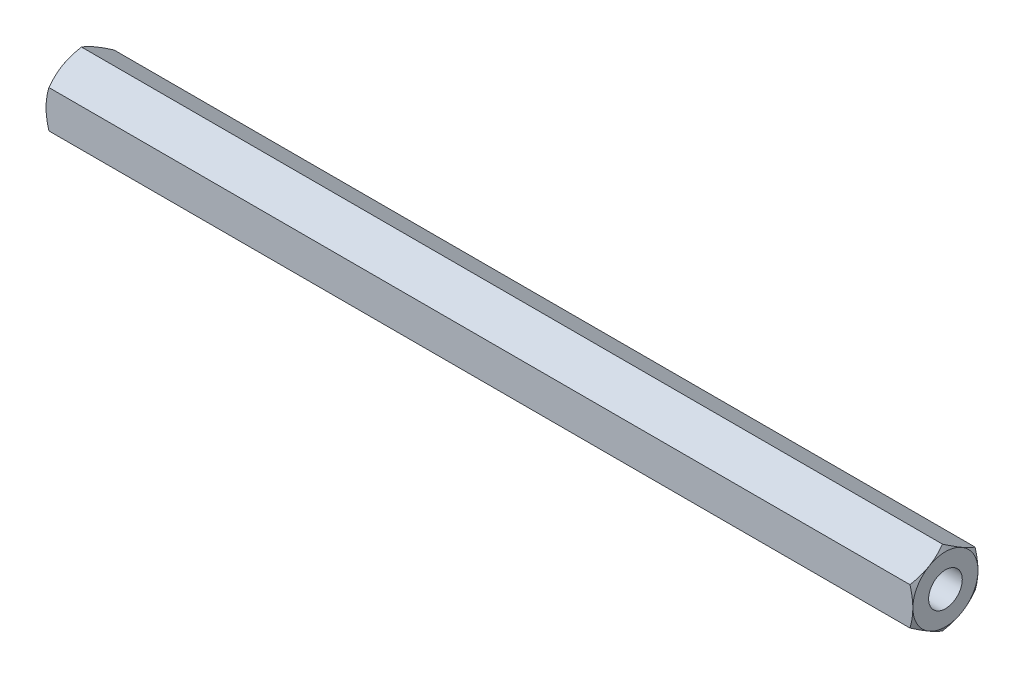
ISO-10303-21;
HEADER;
FILE_DESCRIPTION(('STEP AP214'),'2;1');
FILE_NAME('part.step','',(''),(''),'','','');
FILE_SCHEMA(('AUTOMOTIVE_DESIGN { 1 0 10303 214 1 1 1 1 }'));
ENDSEC;
DATA;
#1=APPLICATION_CONTEXT('core data for automotive mechanical design processes');
#2=APPLICATION_PROTOCOL_DEFINITION('international standard','automotive_design',2000,#1);
#3=PRODUCT_CONTEXT('',#1,'mechanical');
#4=PRODUCT('Part','Part','',(#3));
#5=PRODUCT_RELATED_PRODUCT_CATEGORY('part','',(#4));
#6=PRODUCT_DEFINITION_FORMATION('','',#4);
#7=PRODUCT_DEFINITION_CONTEXT('part definition',#1,'design');
#8=PRODUCT_DEFINITION('design','',#6,#7);
#9=PRODUCT_DEFINITION_SHAPE('','',#8);
#10=(LENGTH_UNIT() NAMED_UNIT(*) SI_UNIT(.MILLI.,.METRE.));
#11=(NAMED_UNIT(*) PLANE_ANGLE_UNIT() SI_UNIT($,.RADIAN.));
#12=(NAMED_UNIT(*) SI_UNIT($,.STERADIAN.) SOLID_ANGLE_UNIT());
#13=UNCERTAINTY_MEASURE_WITH_UNIT(LENGTH_MEASURE(1.E-05),#10,'distance_accuracy_value','');
#14=(GEOMETRIC_REPRESENTATION_CONTEXT(3) GLOBAL_UNCERTAINTY_ASSIGNED_CONTEXT((#13)) GLOBAL_UNIT_ASSIGNED_CONTEXT((#10,
#11,#12)) REPRESENTATION_CONTEXT('',''));
#15=CARTESIAN_POINT('',(0.,0.,0.));
#16=DIRECTION('',(0.,0.,1.));
#17=DIRECTION('',(1.,0.,0.));
#18=AXIS2_PLACEMENT_3D('',#15,#16,#17);
#19=CARTESIAN_POINT('',(106.5,-2.3094010767585,4.));
#20=DIRECTION('',(0.,0.866025403784439,-0.5));
#21=DIRECTION('',(0.,0.5,0.866025403784439));
#22=AXIS2_PLACEMENT_3D('',#19,#20,#21);
#23=PLANE('',#22);
#24=CARTESIAN_POINT('',(106.142667740925,-2.30928560670466,4.0002));
#25=CARTESIAN_POINT('',(106.201282126352,-2.4107717464617,3.82442084967677));
#26=CARTESIAN_POINT('',(106.254589678538,-2.51313390883499,3.64712438367362));
#27=CARTESIAN_POINT('',(106.347638329254,-2.71963072479811,3.28946140682429));
#28=CARTESIAN_POINT('',(106.38734651097,-2.82376904741904,3.10908854102985));
#29=CARTESIAN_POINT('',(106.44915778472,-3.03075510011795,2.75057818129721));
#30=CARTESIAN_POINT('',(106.471672268477,-3.13357098372492,2.57249584706486));
#31=CARTESIAN_POINT('',(106.498549376853,-3.33968651028528,2.21549328283349));
#32=CARTESIAN_POINT('',(106.502934258573,-3.44298540411434,2.0365743503559));
#33=CARTESIAN_POINT('',(106.49380992706,-3.63600352522932,1.70225715780327));
#34=CARTESIAN_POINT('',(106.482541046012,-3.72575165335065,1.54680884001293));
#35=CARTESIAN_POINT('',(106.446826009202,-3.90466320392054,1.23692494436494));
#36=CARTESIAN_POINT('',(106.422367654288,-3.99382600759478,1.08249043825587));
#37=CARTESIAN_POINT('',(106.361223935081,-4.17310641015197,0.771967672225423));
#38=CARTESIAN_POINT('',(106.324279396345,-4.26320131938131,0.615918711936898));
#39=CARTESIAN_POINT('',(106.240429927452,-4.4420474282755,0.306148164596161));
#40=CARTESIAN_POINT('',(106.193544697787,-4.53080091904966,0.152422609226221));
#41=CARTESIAN_POINT('',(106.142667740925,-4.61891762357084,-0.000199999999999231));
#42=B_SPLINE_CURVE_WITH_KNOTS('',3,(#24,#25,#26,#27,#28,#29,#30,#31,#32,#33,#34,#35,#36,#37,#38,
#39,#40,#41),.UNSPECIFIED.,.F.,.F.,(4,2,2,2,2,2,2,2,4),(0.,0.634047835695965,1.26961969224543,
1.88946157213122,2.50854226669297,3.04757825393386,3.58711366126903,4.13861653143764,
4.68903648037743),.UNSPECIFIED.);
#43=CARTESIAN_POINT('',(106.142734410092,-2.3094010767585,4.));
#44=VERTEX_POINT('',#43);
#45=CARTESIAN_POINT('',(106.5,-3.46410161513776,2.));
#46=VERTEX_POINT('',#45);
#47=EDGE_CURVE('E272',#44,#46,#42,.T.);
#48=ORIENTED_EDGE('',*,*,#47,.F.);
#49=DIRECTION('',(-1.,0.,0.));
#50=VECTOR('',#49,1.);
#51=CARTESIAN_POINT('',(106.5,-2.3094010767585,4.));
#52=LINE('',#51,#50);
#53=CARTESIAN_POINT('',(0.357265589908165,-2.30940107675851,4.));
#54=VERTEX_POINT('',#53);
#55=EDGE_CURVE('E337',#44,#54,#52,.T.);
#56=ORIENTED_EDGE('',*,*,#55,.T.);
#57=CARTESIAN_POINT('',(0.357332259074767,-4.61891762357084,-0.00019999999999909));
#58=CARTESIAN_POINT('',(0.298717873648283,-4.5174314838138,0.175579150323229));
#59=CARTESIAN_POINT('',(0.245410321462263,-4.41506932144052,0.352875616326382));
#60=CARTESIAN_POINT('',(0.152361670746403,-4.20857250547739,0.710538593175708));
#61=CARTESIAN_POINT('',(0.112653489029703,-4.10443418285647,0.890911458970153));
#62=CARTESIAN_POINT('',(0.0508422152802781,-3.89744813015756,1.24942181870279));
#63=CARTESIAN_POINT('',(0.0283277315228878,-3.79463224655059,1.42750415293514));
#64=CARTESIAN_POINT('',(0.00145062314658089,-3.58851671999023,1.78450671716651));
#65=CARTESIAN_POINT('',(-0.00293425857305764,-3.48521782616117,1.9634256496441));
#66=CARTESIAN_POINT('',(0.00619007293996928,-3.29219970504619,2.29774284219673));
#67=CARTESIAN_POINT('',(0.0174589539879931,-3.20245157692486,2.45319115998707));
#68=CARTESIAN_POINT('',(0.0531739907981922,-3.02354002635496,2.76307505563506));
#69=CARTESIAN_POINT('',(0.0776323457115324,-2.93437722268072,2.91750956174413));
#70=CARTESIAN_POINT('',(0.138776064919289,-2.75509682012354,3.22803232777458));
#71=CARTESIAN_POINT('',(0.175720603654863,-2.6650019108942,3.3840812880631));
#72=CARTESIAN_POINT('',(0.259570072548027,-2.486155802,3.69385183540384));
#73=CARTESIAN_POINT('',(0.306455302212741,-2.39740231122585,3.84757739077378));
#74=CARTESIAN_POINT('',(0.357332259074768,-2.30928560670466,4.0002));
#75=B_SPLINE_CURVE_WITH_KNOTS('',3,(#57,#58,#59,#60,#61,#62,#63,#64,#65,#66,#67,#68,#69,#70,#71,
#72,#73,#74),.UNSPECIFIED.,.F.,.F.,(4,2,2,2,2,2,2,2,4),(0.,0.634047835695966,1.26961969224544,
1.88946157213122,2.50854226669297,3.04757825393386,3.58711366126904,4.13861653143764,
4.68903648037743),.UNSPECIFIED.);
#76=CARTESIAN_POINT('',(0.,-3.46410161513776,2.));
#77=VERTEX_POINT('',#76);
#78=EDGE_CURVE('E220',#77,#54,#75,.T.);
#79=ORIENTED_EDGE('',*,*,#78,.F.);
#80=CARTESIAN_POINT('',(0.357265589908165,-4.61880215351701,0.));
#81=VERTEX_POINT('',#80);
#82=EDGE_CURVE('E335',#81,#77,#75,.T.);
#83=ORIENTED_EDGE('',*,*,#82,.F.);
#84=DIRECTION('',(-1.,0.,0.));
#85=VECTOR('',#84,1.);
#86=CARTESIAN_POINT('',(106.5,-4.61880215351701,0.));
#87=LINE('',#86,#85);
#88=CARTESIAN_POINT('',(106.142734410092,-4.61880215351701,0.));
#89=VERTEX_POINT('',#88);
#90=EDGE_CURVE('E298',#89,#81,#87,.T.);
#91=ORIENTED_EDGE('',*,*,#90,.F.);
#92=EDGE_CURVE('E267',#46,#89,#42,.T.);
#93=ORIENTED_EDGE('',*,*,#92,.F.);
#94=EDGE_LOOP('',(#48,#56,#79,#83,#91,#93));
#95=FACE_BOUND('',#94,.T.);
#96=ADVANCED_FACE('F41',(#95),#23,.F.);
#97=CARTESIAN_POINT('',(106.5,-4.61880215351701,0.));
#98=DIRECTION('',(0.,0.866025403784439,0.5));
#99=DIRECTION('',(0.,-0.5,0.866025403784439));
#100=AXIS2_PLACEMENT_3D('',#97,#98,#99);
#101=PLANE('',#100);
#102=CARTESIAN_POINT('',(106.142667740925,-4.61891762357084,0.000200000000001131));
#103=CARTESIAN_POINT('',(106.201282126352,-4.5174314838138,-0.175579150323226));
#104=CARTESIAN_POINT('',(106.254589678538,-4.41506932144052,-0.352875616326379));
#105=CARTESIAN_POINT('',(106.347638329254,-4.20857250547739,-0.710538593175705));
#106=CARTESIAN_POINT('',(106.38734651097,-4.10443418285647,-0.89091145897015));
#107=CARTESIAN_POINT('',(106.44915778472,-3.89744813015756,-1.24942181870279));
#108=CARTESIAN_POINT('',(106.471672268477,-3.79463224655059,-1.42750415293514));
#109=CARTESIAN_POINT('',(106.498549376853,-3.58851671999023,-1.78450671716651));
#110=CARTESIAN_POINT('',(106.502934258573,-3.48521782616117,-1.9634256496441));
#111=CARTESIAN_POINT('',(106.49380992706,-3.29219970504619,-2.29774284219673));
#112=CARTESIAN_POINT('',(106.482541046012,-3.20245157692486,-2.45319115998707));
#113=CARTESIAN_POINT('',(106.446826009202,-3.02354002635497,-2.76307505563505));
#114=CARTESIAN_POINT('',(106.422367654288,-2.93437722268073,-2.91750956174413));
#115=CARTESIAN_POINT('',(106.361223935081,-2.75509682012354,-3.22803232777457));
#116=CARTESIAN_POINT('',(106.324279396345,-2.6650019108942,-3.3840812880631));
#117=CARTESIAN_POINT('',(106.240429927452,-2.48615580200001,-3.69385183540383));
#118=CARTESIAN_POINT('',(106.193544697787,-2.39740231122585,-3.84757739077378));
#119=CARTESIAN_POINT('',(106.142667740925,-2.30928560670467,-4.0002));
#120=B_SPLINE_CURVE_WITH_KNOTS('',3,(#102,#103,#104,#105,#106,#107,#108,#109,#110,#111,#112,
#113,#114,#115,#116,#117,#118,#119),.UNSPECIFIED.,.F.,.F.,(4,2,2,2,2,2,2,2,4),(0.,
0.634047835695965,1.26961969224543,1.88946157213122,2.50854226669297,3.04757825393386,
3.58711366126903,4.13861653143763,4.68903648037743),.UNSPECIFIED.);
#121=CARTESIAN_POINT('',(106.5,-3.46410161513776,-2.));
#122=VERTEX_POINT('',#121);
#123=EDGE_CURVE('E260',#89,#122,#120,.T.);
#124=ORIENTED_EDGE('',*,*,#123,.F.);
#125=ORIENTED_EDGE('',*,*,#90,.T.);
#126=CARTESIAN_POINT('',(0.357332259074767,-2.30928560670467,-4.0002));
#127=CARTESIAN_POINT('',(0.298717873648282,-2.41077174646171,-3.82442084967677));
#128=CARTESIAN_POINT('',(0.245410321462262,-2.513133908835,-3.64712438367362));
#129=CARTESIAN_POINT('',(0.152361670746403,-2.71963072479812,-3.28946140682429));
#130=CARTESIAN_POINT('',(0.112653489029703,-2.82376904741904,-3.10908854102985));
#131=CARTESIAN_POINT('',(0.050842215280278,-3.03075510011795,-2.75057818129721));
#132=CARTESIAN_POINT('',(0.0283277315228877,-3.13357098372492,-2.57249584706485));
#133=CARTESIAN_POINT('',(0.00145062314658055,-3.33968651028528,-2.21549328283349));
#134=CARTESIAN_POINT('',(-0.00293425857305807,-3.44298540411434,-2.0365743503559));
#135=CARTESIAN_POINT('',(0.00619007293996919,-3.63600352522932,-1.70225715780326));
#136=CARTESIAN_POINT('',(0.0174589539879934,-3.72575165335065,-1.54680884001293));
#137=CARTESIAN_POINT('',(0.0531739907981926,-3.90466320392054,-1.23692494436494));
#138=CARTESIAN_POINT('',(0.0776323457115326,-3.99382600759478,-1.08249043825587));
#139=CARTESIAN_POINT('',(0.138776064919289,-4.17310641015197,-0.77196767222542));
#140=CARTESIAN_POINT('',(0.175720603654863,-4.26320131938131,-0.615918711936895));
#141=CARTESIAN_POINT('',(0.259570072548027,-4.4420474282755,-0.306148164596159));
#142=CARTESIAN_POINT('',(0.30645530221274,-4.53080091904966,-0.152422609226219));
#143=CARTESIAN_POINT('',(0.357332259074767,-4.61891762357084,0.000200000000001087));
#144=B_SPLINE_CURVE_WITH_KNOTS('',3,(#126,#127,#128,#129,#130,#131,#132,#133,#134,#135,#136,
#137,#138,#139,#140,#141,#142,#143),.UNSPECIFIED.,.F.,.F.,(4,2,2,2,2,2,2,2,4),(0.,
0.634047835695967,1.26961969224543,1.88946157213122,2.50854226669297,3.04757825393386,
3.58711366126903,4.13861653143764,4.68903648037743),.UNSPECIFIED.);
#145=CARTESIAN_POINT('',(0.,-3.46410161513776,-2.));
#146=VERTEX_POINT('',#145);
#147=EDGE_CURVE('E232',#146,#81,#144,.T.);
#148=ORIENTED_EDGE('',*,*,#147,.F.);
#149=CARTESIAN_POINT('',(0.357265589908165,-2.30940107675851,-4.));
#150=VERTEX_POINT('',#149);
#151=EDGE_CURVE('E238',#150,#146,#144,.T.);
#152=ORIENTED_EDGE('',*,*,#151,.F.);
#153=DIRECTION('',(-1.,0.,0.));
#154=VECTOR('',#153,1.);
#155=CARTESIAN_POINT('',(106.5,-2.3094010767585,-4.));
#156=LINE('',#155,#154);
#157=CARTESIAN_POINT('',(106.142734410092,-2.30940107675851,-4.));
#158=VERTEX_POINT('',#157);
#159=EDGE_CURVE('E292',#158,#150,#156,.T.);
#160=ORIENTED_EDGE('',*,*,#159,.F.);
#161=EDGE_CURVE('E254',#122,#158,#120,.T.);
#162=ORIENTED_EDGE('',*,*,#161,.F.);
#163=EDGE_LOOP('',(#124,#125,#148,#152,#160,#162));
#164=FACE_BOUND('',#163,.T.);
#165=ADVANCED_FACE('F246',(#164),#101,.F.);
#166=CARTESIAN_POINT('',(106.5,-2.3094010767585,-4.));
#167=DIRECTION('',(0.,0.,1.));
#168=DIRECTION('',(1.,0.,0.));
#169=AXIS2_PLACEMENT_3D('',#166,#167,#168);
#170=PLANE('',#169);
#171=CARTESIAN_POINT('',(104.585893178759,-6.12487198995893,-4.));
#172=CARTESIAN_POINT('',(104.670763729233,-5.94924937038677,-4.));
#173=CARTESIAN_POINT('',(104.754790596193,-5.77321152095287,-4.));
#174=CARTESIAN_POINT('',(104.920674853203,-5.42008084777955,-4.));
#175=CARTESIAN_POINT('',(105.002531867633,-5.24298784779928,-4.));
#176=CARTESIAN_POINT('',(105.164025536941,-4.88656571686334,-4.));
#177=CARTESIAN_POINT('',(105.243646804937,-4.70722958889362,-4.));
#178=CARTESIAN_POINT('',(105.39946941458,-4.34708334747264,-4.));
#179=CARTESIAN_POINT('',(105.475670934492,-4.16627331143538,-4.));
#180=CARTESIAN_POINT('',(105.624649349606,-3.80064706744978,-4.));
#181=CARTESIAN_POINT('',(105.697372715784,-3.6158089282277,-4.));
#182=CARTESIAN_POINT('',(105.837123769041,-3.24395246794968,-4.));
#183=CARTESIAN_POINT('',(105.904150822433,-3.05693390695801,-4.));
#184=CARTESIAN_POINT('',(106.030708251569,-2.68080318253771,-4.));
#185=CARTESIAN_POINT('',(106.090254565216,-2.49169643712849,-4.));
#186=CARTESIAN_POINT('',(106.199916643455,-2.11079454635851,-4.));
#187=CARTESIAN_POINT('',(106.250035390323,-1.91900027185749,-4.));
#188=CARTESIAN_POINT('',(106.338409205046,-1.532592326982,-4.));
#189=CARTESIAN_POINT('',(106.376661114043,-1.3379779203165,-4.));
#190=CARTESIAN_POINT('',(106.438725764078,-0.946402725872555,-4.));
#191=CARTESIAN_POINT('',(106.462538492348,-0.749441936019776,-4.));
#192=CARTESIAN_POINT('',(106.493618186851,-0.355451989627945,-4.));
#193=CARTESIAN_POINT('',(106.500989900761,-0.158431311094014,-4.));
#194=CARTESIAN_POINT('',(106.498795933625,0.235472085607466,-4.));
#195=CARTESIAN_POINT('',(106.489234649185,0.432354826312202,-4.));
#196=CARTESIAN_POINT('',(106.459121265386,0.768560635225518,-4.));
#197=CARTESIAN_POINT('',(106.442490703956,0.908254618381824,-4.));
#198=CARTESIAN_POINT('',(106.401786589653,1.18656349063498,-4.));
#199=CARTESIAN_POINT('',(106.377711862942,1.32517820601014,-4.));
#200=CARTESIAN_POINT('',(106.29558492905,1.73929045452971,-4.));
#201=CARTESIAN_POINT('',(106.227651113575,2.01284690528725,-4.));
#202=CARTESIAN_POINT('',(106.110483640683,2.42218253014527,-4.));
#203=CARTESIAN_POINT('',(106.068286058188,2.56009536361542,-4.));
#204=CARTESIAN_POINT('',(105.979715419772,2.83448159101407,-4.));
#205=CARTESIAN_POINT('',(105.933345243813,2.97095590623561,-4.));
#206=CARTESIAN_POINT('',(105.83739430082,3.24189440516345,-4.));
#207=CARTESIAN_POINT('',(105.787833074246,3.37636557946843,-4.));
#208=CARTESIAN_POINT('',(105.685801646209,3.64426461152919,-4.));
#209=CARTESIAN_POINT('',(105.633330269037,3.77769202239393,-4.));
#210=CARTESIAN_POINT('',(105.579690993458,3.9106369898669,-4.));
#211=B_SPLINE_CURVE_WITH_KNOTS('',3,(#171,#172,#173,#174,#175,#176,#177,#178,#179,#180,#181,
#182,#183,#184,#185,#186,#187,#188,#189,#190,#191,#192,#193,#194,#195,#196,#197,#198,#199,#200,
#201,#202,#203,#204,#205,#206,#207,#208,#209,#210),.UNSPECIFIED.,.F.,.F.,(4,2,2,2,2,2,2,2,2,2,2,
2,2,2,2,2,2,2,2,4),(0.,0.585171792532275,1.17044423059927,1.7590659464599,2.34765694284827,
2.94347400997483,3.53935727210689,4.13394864697601,4.72835161391471,5.32291267067845,
5.91747425310812,6.50823685854036,7.09884609659886,7.52068140825522,7.94258327130841,
8.78701491359832,9.21965281897693,9.65199437116302,10.0819024146297,10.5119854255247),.UNSPECIFIED.);
#212=CARTESIAN_POINT('',(106.5,0.,-4.));
#213=VERTEX_POINT('',#212);
#214=EDGE_CURVE('E261',#158,#213,#211,.T.);
#215=ORIENTED_EDGE('',*,*,#214,.F.);
#216=ORIENTED_EDGE('',*,*,#159,.T.);
#217=CARTESIAN_POINT('',(1.91410682124063,-6.12487198995892,-4.));
#218=CARTESIAN_POINT('',(1.82923627076689,-5.94924937038676,-4.));
#219=CARTESIAN_POINT('',(1.74520940380739,-5.77321152095285,-4.));
#220=CARTESIAN_POINT('',(1.57932514679716,-5.42008084777954,-4.));
#221=CARTESIAN_POINT('',(1.49746813236723,-5.24298784779927,-4.));
#222=CARTESIAN_POINT('',(1.33597446305855,-4.88656571686333,-4.));
#223=CARTESIAN_POINT('',(1.25635319506303,-4.70722958889362,-4.));
#224=CARTESIAN_POINT('',(1.10053058542029,-4.34708334747263,-4.));
#225=CARTESIAN_POINT('',(1.02432906550802,-4.16627331143537,-4.));
#226=CARTESIAN_POINT('',(0.875350650394358,-3.80064706744977,-4.));
#227=CARTESIAN_POINT('',(0.802627284215842,-3.61580892822769,-4.));
#228=CARTESIAN_POINT('',(0.662876230959417,-3.24395246794968,-4.));
#229=CARTESIAN_POINT('',(0.595849177566501,-3.05693390695801,-4.));
#230=CARTESIAN_POINT('',(0.469291748430879,-2.6808031825377,-4.));
#231=CARTESIAN_POINT('',(0.409745434783834,-2.49169643712848,-4.));
#232=CARTESIAN_POINT('',(0.300083356544504,-2.11079454635851,-4.));
#233=CARTESIAN_POINT('',(0.249964609676749,-1.91900027185748,-4.));
#234=CARTESIAN_POINT('',(0.16159079495404,-1.532592326982,-4.));
#235=CARTESIAN_POINT('',(0.123338885956538,-1.33797792031649,-4.));
#236=CARTESIAN_POINT('',(0.0612742359223416,-0.946402725872551,-4.));
#237=CARTESIAN_POINT('',(0.0374615076516972,-0.749441936019771,-4.));
#238=CARTESIAN_POINT('',(0.00638181314943469,-0.355451989627941,-4.));
#239=CARTESIAN_POINT('',(-0.000989900761042853,-0.15843131109401,-4.));
#240=CARTESIAN_POINT('',(0.00120406637479438,0.23547208560747,-4.));
#241=CARTESIAN_POINT('',(0.0107653508153497,0.432354826312206,-4.));
#242=CARTESIAN_POINT('',(0.0408787346135899,0.768560635225519,-4.));
#243=CARTESIAN_POINT('',(0.0575092960439091,0.908254618381822,-4.));
#244=CARTESIAN_POINT('',(0.0982134103466913,1.18656349063498,-4.));
#245=CARTESIAN_POINT('',(0.122288137058446,1.32517820601014,-4.));
#246=CARTESIAN_POINT('',(0.204415070950231,1.7392904545297,-4.));
#247=CARTESIAN_POINT('',(0.272348886425154,2.01284690528723,-4.));
#248=CARTESIAN_POINT('',(0.389516359317205,2.42218253014525,-4.));
#249=CARTESIAN_POINT('',(0.431713941811638,2.56009536361539,-4.));
#250=CARTESIAN_POINT('',(0.520284580227764,2.83448159101405,-4.));
#251=CARTESIAN_POINT('',(0.566654756186914,2.97095590623558,-4.));
#252=CARTESIAN_POINT('',(0.662605699180289,3.24189440516342,-4.));
#253=CARTESIAN_POINT('',(0.712166925753503,3.37636557946839,-4.));
#254=CARTESIAN_POINT('',(0.814198353790705,3.64426461152915,-4.));
#255=CARTESIAN_POINT('',(0.866669730963372,3.77769202239388,-4.));
#256=CARTESIAN_POINT('',(0.920309006541796,3.91063698986685,-4.));
#257=B_SPLINE_CURVE_WITH_KNOTS('',3,(#217,#218,#219,#220,#221,#222,#223,#224,#225,#226,#227,
#228,#229,#230,#231,#232,#233,#234,#235,#236,#237,#238,#239,#240,#241,#242,#243,#244,#245,#246,
#247,#248,#249,#250,#251,#252,#253,#254,#255,#256),.UNSPECIFIED.,.F.,.F.,(4,2,2,2,2,2,2,2,2,2,2,
2,2,2,2,2,2,2,2,4),(0.,0.585171792532272,1.17044423059927,1.7590659464599,2.34765694284827,
2.94347400997483,3.53935727210689,4.133948646976,4.72835161391471,5.32291267067845,
5.91747425310812,6.50823685854036,7.09884609659886,7.52068140825521,7.94258327130839,
8.7870149135983,9.21965281897689,9.65199437116298,10.0819024146297,10.5119854255247),.UNSPECIFIED.);
#258=CARTESIAN_POINT('',(0.,0.,-4.));
#259=VERTEX_POINT('',#258);
#260=EDGE_CURVE('E239',#259,#150,#257,.F.);
#261=ORIENTED_EDGE('',*,*,#260,.F.);
#262=CARTESIAN_POINT('',(0.357265589908165,2.3094010767585,-4.));
#263=VERTEX_POINT('',#262);
#264=EDGE_CURVE('E346',#263,#259,#257,.F.);
#265=ORIENTED_EDGE('',*,*,#264,.F.);
#266=DIRECTION('',(-1.,0.,0.));
#267=VECTOR('',#266,1.);
#268=CARTESIAN_POINT('',(106.5,2.30940107675851,-4.));
#269=LINE('',#268,#267);
#270=CARTESIAN_POINT('',(106.142734410092,2.30940107675851,-4.));
#271=VERTEX_POINT('',#270);
#272=EDGE_CURVE('E299',#271,#263,#269,.T.);
#273=ORIENTED_EDGE('',*,*,#272,.F.);
#274=EDGE_CURVE('E262',#213,#271,#211,.T.);
#275=ORIENTED_EDGE('',*,*,#274,.F.);
#276=EDGE_LOOP('',(#215,#216,#261,#265,#273,#275));
#277=FACE_BOUND('',#276,.T.);
#278=ADVANCED_FACE('F249',(#277),#170,.F.);
#279=CARTESIAN_POINT('',(106.5,2.30940107675851,-4.));
#280=DIRECTION('',(0.,-0.866025403784438,0.5));
#281=DIRECTION('',(0.,-0.5,-0.866025403784439));
#282=AXIS2_PLACEMENT_3D('',#279,#280,#281);
#283=PLANE('',#282);
#284=CARTESIAN_POINT('',(106.142667740925,2.30928560670467,-4.0002));
#285=CARTESIAN_POINT('',(106.201282126352,2.41077174646171,-3.82442084967677));
#286=CARTESIAN_POINT('',(106.254589678538,2.513133908835,-3.64712438367362));
#287=CARTESIAN_POINT('',(106.347638329254,2.71963072479812,-3.2894614068243));
#288=CARTESIAN_POINT('',(106.38734651097,2.82376904741904,-3.10908854102985));
#289=CARTESIAN_POINT('',(106.44915778472,3.03075510011795,-2.75057818129721));
#290=CARTESIAN_POINT('',(106.471672268477,3.13357098372492,-2.57249584706486));
#291=CARTESIAN_POINT('',(106.498549376853,3.33968651028528,-2.21549328283349));
#292=CARTESIAN_POINT('',(106.502934258573,3.44298540411434,-2.0365743503559));
#293=CARTESIAN_POINT('',(106.49380992706,3.63600352522932,-1.70225715780327));
#294=CARTESIAN_POINT('',(106.482541046012,3.72575165335065,-1.54680884001293));
#295=CARTESIAN_POINT('',(106.446826009202,3.90466320392054,-1.23692494436495));
#296=CARTESIAN_POINT('',(106.422367654288,3.99382600759479,-1.08249043825587));
#297=CARTESIAN_POINT('',(106.361223935081,4.17310641015197,-0.771967672225423));
#298=CARTESIAN_POINT('',(106.324279396345,4.26320131938131,-0.615918711936899));
#299=CARTESIAN_POINT('',(106.240429927452,4.44204742827551,-0.306148164596161));
#300=CARTESIAN_POINT('',(106.193544697787,4.53080091904966,-0.152422609226221));
#301=CARTESIAN_POINT('',(106.142667740925,4.61891762357085,0.000199999999998659));
#302=B_SPLINE_CURVE_WITH_KNOTS('',3,(#284,#285,#286,#287,#288,#289,#290,#291,#292,#293,#294,
#295,#296,#297,#298,#299,#300,#301),.UNSPECIFIED.,.F.,.F.,(4,2,2,2,2,2,2,2,4),(0.,
0.634047835695961,1.26961969224543,1.88946157213122,2.50854226669297,3.04757825393385,
3.58711366126903,4.13861653143763,4.68903648037743),.UNSPECIFIED.);
#303=CARTESIAN_POINT('',(106.5,3.46410161513776,-2.));
#304=VERTEX_POINT('',#303);
#305=EDGE_CURVE('E360',#271,#304,#302,.T.);
#306=ORIENTED_EDGE('',*,*,#305,.F.);
#307=ORIENTED_EDGE('',*,*,#272,.T.);
#308=CARTESIAN_POINT('',(0.357332259074769,4.61891762357085,0.000199999999999029));
#309=CARTESIAN_POINT('',(0.298717873648285,4.51743148381381,-0.175579150323229));
#310=CARTESIAN_POINT('',(0.245410321462264,4.41506932144052,-0.352875616326382));
#311=CARTESIAN_POINT('',(0.152361670746404,4.2085725054774,-0.710538593175708));
#312=CARTESIAN_POINT('',(0.112653489029704,4.10443418285647,-0.890911458970153));
#313=CARTESIAN_POINT('',(0.0508422152802789,3.89744813015756,-1.24942181870279));
#314=CARTESIAN_POINT('',(0.0283277315228891,3.79463224655059,-1.42750415293515));
#315=CARTESIAN_POINT('',(0.00145062314658209,3.58851671999023,-1.78450671716651));
#316=CARTESIAN_POINT('',(-0.00293425857305701,3.48521782616117,-1.9634256496441));
#317=CARTESIAN_POINT('',(0.00619007293997012,3.29219970504619,-2.29774284219674));
#318=CARTESIAN_POINT('',(0.0174589539879945,3.20245157692486,-2.45319115998707));
#319=CARTESIAN_POINT('',(0.0531739907981938,3.02354002635497,-2.76307505563506));
#320=CARTESIAN_POINT('',(0.0776323457115336,2.93437722268073,-2.91750956174413));
#321=CARTESIAN_POINT('',(0.13877606491929,2.75509682012354,-3.22803232777458));
#322=CARTESIAN_POINT('',(0.175720603654864,2.6650019108942,-3.3840812880631));
#323=CARTESIAN_POINT('',(0.259570072548028,2.48615580200001,-3.69385183540384));
#324=CARTESIAN_POINT('',(0.306455302212741,2.39740231122585,-3.84757739077378));
#325=CARTESIAN_POINT('',(0.357332259074767,2.30928560670467,-4.0002));
#326=B_SPLINE_CURVE_WITH_KNOTS('',3,(#308,#309,#310,#311,#312,#313,#314,#315,#316,#317,#318,
#319,#320,#321,#322,#323,#324,#325),.UNSPECIFIED.,.F.,.F.,(4,2,2,2,2,2,2,2,4),(0.,
0.634047835695967,1.26961969224544,1.88946157213122,2.50854226669297,3.04757825393386,
3.58711366126903,4.13861653143764,4.68903648037743),.UNSPECIFIED.);
#327=CARTESIAN_POINT('',(0.,3.46410161513776,-2.));
#328=VERTEX_POINT('',#327);
#329=EDGE_CURVE('E343',#328,#263,#326,.T.);
#330=ORIENTED_EDGE('',*,*,#329,.F.);
#331=CARTESIAN_POINT('',(0.357265589908165,4.61880215351701,0.));
#332=VERTEX_POINT('',#331);
#333=EDGE_CURVE('E226',#332,#328,#326,.T.);
#334=ORIENTED_EDGE('',*,*,#333,.F.);
#335=DIRECTION('',(-1.,0.,0.));
#336=VECTOR('',#335,1.);
#337=CARTESIAN_POINT('',(106.5,4.61880215351701,0.));
#338=LINE('',#337,#336);
#339=CARTESIAN_POINT('',(106.142734410092,4.61880215351701,0.));
#340=VERTEX_POINT('',#339);
#341=EDGE_CURVE('E303',#340,#332,#338,.T.);
#342=ORIENTED_EDGE('',*,*,#341,.F.);
#343=EDGE_CURVE('E359',#304,#340,#302,.T.);
#344=ORIENTED_EDGE('',*,*,#343,.F.);
#345=EDGE_LOOP('',(#306,#307,#330,#334,#342,#344));
#346=FACE_BOUND('',#345,.T.);
#347=ADVANCED_FACE('F358',(#346),#283,.F.);
#348=CARTESIAN_POINT('',(106.5,4.61880215351701,0.));
#349=DIRECTION('',(0.,-0.866025403784439,-0.5));
#350=DIRECTION('',(0.,0.5,-0.866025403784439));
#351=AXIS2_PLACEMENT_3D('',#348,#349,#350);
#352=PLANE('',#351);
#353=CARTESIAN_POINT('',(106.142667740925,4.61891762357085,-0.000200000000000971));
#354=CARTESIAN_POINT('',(106.201282126352,4.51743148381381,0.175579150323225));
#355=CARTESIAN_POINT('',(106.254589678538,4.41506932144052,0.352875616326376));
#356=CARTESIAN_POINT('',(106.347638329254,4.2085725054774,0.710538593175702));
#357=CARTESIAN_POINT('',(106.38734651097,4.10443418285647,0.890911458970147));
#358=CARTESIAN_POINT('',(106.44915778472,3.89744813015756,1.24942181870279));
#359=CARTESIAN_POINT('',(106.471672268477,3.7946322465506,1.42750415293514));
#360=CARTESIAN_POINT('',(106.498549376853,3.58851671999023,1.7845067171665));
#361=CARTESIAN_POINT('',(106.502934258573,3.48521782616117,1.9634256496441));
#362=CARTESIAN_POINT('',(106.49380992706,3.29219970504619,2.29774284219673));
#363=CARTESIAN_POINT('',(106.482541046012,3.20245157692487,2.45319115998706));
#364=CARTESIAN_POINT('',(106.446826009202,3.02354002635497,2.76307505563505));
#365=CARTESIAN_POINT('',(106.422367654288,2.93437722268073,2.91750956174413));
#366=CARTESIAN_POINT('',(106.361223935081,2.75509682012354,3.22803232777458));
#367=CARTESIAN_POINT('',(106.324279396345,2.6650019108942,3.3840812880631));
#368=CARTESIAN_POINT('',(106.240429927452,2.48615580200001,3.69385183540384));
#369=CARTESIAN_POINT('',(106.193544697787,2.39740231122585,3.84757739077378));
#370=CARTESIAN_POINT('',(106.142667740925,2.30928560670467,4.0002));
#371=B_SPLINE_CURVE_WITH_KNOTS('',3,(#353,#354,#355,#356,#357,#358,#359,#360,#361,#362,#363,
#364,#365,#366,#367,#368,#369,#370),.UNSPECIFIED.,.F.,.F.,(4,2,2,2,2,2,2,2,4),(0.,
0.634047835695961,1.26961969224543,1.88946157213122,2.50854226669297,3.04757825393385,
3.58711366126903,4.13861653143764,4.68903648037743),.UNSPECIFIED.);
#372=CARTESIAN_POINT('',(106.5,3.46410161513776,2.));
#373=VERTEX_POINT('',#372);
#374=EDGE_CURVE('E354',#340,#373,#371,.T.);
#375=ORIENTED_EDGE('',*,*,#374,.F.);
#376=ORIENTED_EDGE('',*,*,#341,.T.);
#377=CARTESIAN_POINT('',(0.357332259074768,2.30928560670467,4.0002));
#378=CARTESIAN_POINT('',(0.298717873648284,2.41077174646171,3.82442084967677));
#379=CARTESIAN_POINT('',(0.245410321462264,2.513133908835,3.64712438367362));
#380=CARTESIAN_POINT('',(0.152361670746404,2.71963072479812,3.28946140682429));
#381=CARTESIAN_POINT('',(0.112653489029704,2.82376904741904,3.10908854102985));
#382=CARTESIAN_POINT('',(0.0508422152802788,3.03075510011795,2.75057818129721));
#383=CARTESIAN_POINT('',(0.0283277315228887,3.13357098372492,2.57249584706486));
#384=CARTESIAN_POINT('',(0.00145062314658153,3.33968651028529,2.21549328283349));
#385=CARTESIAN_POINT('',(-0.00293425857305726,3.44298540411434,2.0365743503559));
#386=CARTESIAN_POINT('',(0.00619007293996989,3.63600352522933,1.70225715780327));
#387=CARTESIAN_POINT('',(0.0174589539879941,3.72575165335065,1.54680884001293));
#388=CARTESIAN_POINT('',(0.0531739907981935,3.90466320392055,1.23692494436494));
#389=CARTESIAN_POINT('',(0.0776323457115335,3.99382600759479,1.08249043825587));
#390=CARTESIAN_POINT('',(0.13877606491929,4.17310641015197,0.771967672225421));
#391=CARTESIAN_POINT('',(0.175720603654864,4.26320131938131,0.615918711936897));
#392=CARTESIAN_POINT('',(0.259570072548028,4.44204742827551,0.30614816459616));
#393=CARTESIAN_POINT('',(0.306455302212742,4.53080091904966,0.152422609226219));
#394=CARTESIAN_POINT('',(0.357332259074769,4.61891762357085,-0.000200000000001357));
#395=B_SPLINE_CURVE_WITH_KNOTS('',3,(#377,#378,#379,#380,#381,#382,#383,#384,#385,#386,#387,
#388,#389,#390,#391,#392,#393,#394),.UNSPECIFIED.,.F.,.F.,(4,2,2,2,2,2,2,2,4),(0.,
0.634047835695967,1.26961969224544,1.88946157213122,2.50854226669297,3.04757825393386,
3.58711366126904,4.13861653143764,4.68903648037743),.UNSPECIFIED.);
#396=CARTESIAN_POINT('',(0.,3.46410161513776,2.));
#397=VERTEX_POINT('',#396);
#398=EDGE_CURVE('E338',#397,#332,#395,.T.);
#399=ORIENTED_EDGE('',*,*,#398,.F.);
#400=CARTESIAN_POINT('',(0.357265589908165,2.30940107675851,4.));
#401=VERTEX_POINT('',#400);
#402=EDGE_CURVE('E201',#401,#397,#395,.T.);
#403=ORIENTED_EDGE('',*,*,#402,.F.);
#404=DIRECTION('',(-1.,0.,0.));
#405=VECTOR('',#404,1.);
#406=CARTESIAN_POINT('',(106.5,2.3094010767585,4.));
#407=LINE('',#406,#405);
#408=CARTESIAN_POINT('',(106.142734410092,2.3094010767585,4.));
#409=VERTEX_POINT('',#408);
#410=EDGE_CURVE('E348',#409,#401,#407,.T.);
#411=ORIENTED_EDGE('',*,*,#410,.F.);
#412=EDGE_CURVE('E166',#373,#409,#371,.T.);
#413=ORIENTED_EDGE('',*,*,#412,.F.);
#414=EDGE_LOOP('',(#375,#376,#399,#403,#411,#413));
#415=FACE_BOUND('',#414,.T.);
#416=ADVANCED_FACE('F182',(#415),#352,.F.);
#417=CARTESIAN_POINT('',(106.5,2.3094010767585,4.));
#418=DIRECTION('',(0.,0.,-1.));
#419=DIRECTION('',(-1.,0.,0.));
#420=AXIS2_PLACEMENT_3D('',#417,#418,#419);
#421=PLANE('',#420);
#422=CARTESIAN_POINT('',(104.585893178759,-6.12487198995893,4.));
#423=CARTESIAN_POINT('',(104.670763729233,-5.94924937038677,4.));
#424=CARTESIAN_POINT('',(104.754790596193,-5.77321152095286,4.));
#425=CARTESIAN_POINT('',(104.920674853203,-5.42008084777955,4.));
#426=CARTESIAN_POINT('',(105.002531867633,-5.24298784779928,4.));
#427=CARTESIAN_POINT('',(105.164025536941,-4.88656571686334,4.));
#428=CARTESIAN_POINT('',(105.243646804937,-4.70722958889362,4.));
#429=CARTESIAN_POINT('',(105.39946941458,-4.34708334747263,4.));
#430=CARTESIAN_POINT('',(105.475670934492,-4.16627331143538,4.));
#431=CARTESIAN_POINT('',(105.624649349606,-3.80064706744977,4.));
#432=CARTESIAN_POINT('',(105.697372715784,-3.6158089282277,4.));
#433=CARTESIAN_POINT('',(105.837123769041,-3.24395246794968,4.));
#434=CARTESIAN_POINT('',(105.904150822433,-3.05693390695801,4.));
#435=CARTESIAN_POINT('',(106.030708251569,-2.6808031825377,4.));
#436=CARTESIAN_POINT('',(106.090254565216,-2.49169643712848,4.));
#437=CARTESIAN_POINT('',(106.199916643455,-2.1107945463585,4.));
#438=CARTESIAN_POINT('',(106.250035390323,-1.91900027185748,4.));
#439=CARTESIAN_POINT('',(106.338409205046,-1.532592326982,4.));
#440=CARTESIAN_POINT('',(106.376661114043,-1.33797792031649,4.));
#441=CARTESIAN_POINT('',(106.438725764078,-0.946402725872551,4.));
#442=CARTESIAN_POINT('',(106.462538492348,-0.749441936019772,4.));
#443=CARTESIAN_POINT('',(106.493618186851,-0.355451989627941,4.));
#444=CARTESIAN_POINT('',(106.500989900761,-0.15843131109401,4.));
#445=CARTESIAN_POINT('',(106.498795933625,0.235472085607469,4.));
#446=CARTESIAN_POINT('',(106.489234649185,0.432354826312206,4.));
#447=CARTESIAN_POINT('',(106.459121265386,0.768560635225521,4.));
#448=CARTESIAN_POINT('',(106.442490703956,0.908254618381827,4.));
#449=CARTESIAN_POINT('',(106.401786589653,1.18656349063498,4.));
#450=CARTESIAN_POINT('',(106.377711862942,1.32517820601015,4.));
#451=CARTESIAN_POINT('',(106.29558492905,1.73929045452971,4.));
#452=CARTESIAN_POINT('',(106.227651113575,2.01284690528725,4.));
#453=CARTESIAN_POINT('',(106.110483640683,2.42218253014527,4.));
#454=CARTESIAN_POINT('',(106.068286058188,2.56009536361542,4.));
#455=CARTESIAN_POINT('',(105.979715419772,2.83448159101408,4.));
#456=CARTESIAN_POINT('',(105.933345243813,2.97095590623562,4.));
#457=CARTESIAN_POINT('',(105.83739430082,3.24189440516346,4.));
#458=CARTESIAN_POINT('',(105.787833074246,3.37636557946843,4.));
#459=CARTESIAN_POINT('',(105.685801646209,3.6442646115292,4.));
#460=CARTESIAN_POINT('',(105.633330269037,3.77769202239393,4.));
#461=CARTESIAN_POINT('',(105.579690993458,3.91063698986691,4.));
#462=B_SPLINE_CURVE_WITH_KNOTS('',3,(#422,#423,#424,#425,#426,#427,#428,#429,#430,#431,#432,
#433,#434,#435,#436,#437,#438,#439,#440,#441,#442,#443,#444,#445,#446,#447,#448,#449,#450,#451,
#452,#453,#454,#455,#456,#457,#458,#459,#460,#461),.UNSPECIFIED.,.F.,.F.,(4,2,2,2,2,2,2,2,2,2,2,
2,2,2,2,2,2,2,2,4),(0.,0.585171792532273,1.17044423059927,1.7590659464599,2.34765694284827,
2.94347400997483,3.53935727210689,4.13394864697601,4.72835161391471,5.32291267067845,
5.91747425310812,6.50823685854036,7.09884609659886,7.52068140825522,7.94258327130841,
8.78701491359832,9.21965281897692,9.65199437116302,10.0819024146298,10.5119854255247),.UNSPECIFIED.);
#463=CARTESIAN_POINT('',(106.5,0.,4.));
#464=VERTEX_POINT('',#463);
#465=EDGE_CURVE('E165',#409,#464,#462,.F.);
#466=ORIENTED_EDGE('',*,*,#465,.F.);
#467=ORIENTED_EDGE('',*,*,#410,.T.);
#468=CARTESIAN_POINT('',(1.91410682124064,-6.12487198995891,4.));
#469=CARTESIAN_POINT('',(1.82923627076689,-5.94924937038676,4.));
#470=CARTESIAN_POINT('',(1.74520940380739,-5.77321152095285,4.));
#471=CARTESIAN_POINT('',(1.57932514679716,-5.42008084777954,4.));
#472=CARTESIAN_POINT('',(1.49746813236723,-5.24298784779927,4.));
#473=CARTESIAN_POINT('',(1.33597446305855,-4.88656571686333,4.));
#474=CARTESIAN_POINT('',(1.25635319506303,-4.70722958889362,4.));
#475=CARTESIAN_POINT('',(1.10053058542029,-4.34708334747263,4.));
#476=CARTESIAN_POINT('',(1.02432906550802,-4.16627331143537,4.));
#477=CARTESIAN_POINT('',(0.875350650394359,-3.80064706744977,4.));
#478=CARTESIAN_POINT('',(0.802627284215842,-3.61580892822769,4.));
#479=CARTESIAN_POINT('',(0.662876230959417,-3.24395246794968,4.));
#480=CARTESIAN_POINT('',(0.595849177566501,-3.05693390695801,4.));
#481=CARTESIAN_POINT('',(0.469291748430879,-2.6808031825377,4.));
#482=CARTESIAN_POINT('',(0.409745434783835,-2.49169643712848,4.));
#483=CARTESIAN_POINT('',(0.300083356544505,-2.11079454635851,4.));
#484=CARTESIAN_POINT('',(0.24996460967675,-1.91900027185748,4.));
#485=CARTESIAN_POINT('',(0.16159079495404,-1.53259232698199,4.));
#486=CARTESIAN_POINT('',(0.123338885956539,-1.33797792031649,4.));
#487=CARTESIAN_POINT('',(0.0612742359223426,-0.946402725872548,4.));
#488=CARTESIAN_POINT('',(0.0374615076516981,-0.749441936019768,4.));
#489=CARTESIAN_POINT('',(0.0063818131494358,-0.355451989627937,4.));
#490=CARTESIAN_POINT('',(-0.000989900761041474,-0.158431311094006,4.));
#491=CARTESIAN_POINT('',(0.001204066374796,0.235472085607473,4.));
#492=CARTESIAN_POINT('',(0.0107653508153513,0.432354826312209,4.));
#493=CARTESIAN_POINT('',(0.0408787346135914,0.768560635225521,4.));
#494=CARTESIAN_POINT('',(0.0575092960439106,0.908254618381824,4.));
#495=CARTESIAN_POINT('',(0.098213410346693,1.18656349063498,4.));
#496=CARTESIAN_POINT('',(0.122288137058448,1.32517820601014,4.));
#497=CARTESIAN_POINT('',(0.204415070950233,1.7392904545297,4.));
#498=CARTESIAN_POINT('',(0.272348886425156,2.01284690528723,4.));
#499=CARTESIAN_POINT('',(0.389516359317207,2.42218253014525,4.));
#500=CARTESIAN_POINT('',(0.43171394181164,2.56009536361539,4.));
#501=CARTESIAN_POINT('',(0.520284580227766,2.83448159101405,4.));
#502=CARTESIAN_POINT('',(0.566654756186916,2.97095590623559,4.));
#503=CARTESIAN_POINT('',(0.662605699180291,3.24189440516342,4.));
#504=CARTESIAN_POINT('',(0.712166925753505,3.37636557946839,4.));
#505=CARTESIAN_POINT('',(0.814198353790707,3.64426461152915,4.));
#506=CARTESIAN_POINT('',(0.866669730963375,3.77769202239389,4.));
#507=CARTESIAN_POINT('',(0.920309006541799,3.91063698986686,4.));
#508=B_SPLINE_CURVE_WITH_KNOTS('',3,(#468,#469,#470,#471,#472,#473,#474,#475,#476,#477,#478,
#479,#480,#481,#482,#483,#484,#485,#486,#487,#488,#489,#490,#491,#492,#493,#494,#495,#496,#497,
#498,#499,#500,#501,#502,#503,#504,#505,#506,#507),.UNSPECIFIED.,.F.,.F.,(4,2,2,2,2,2,2,2,2,2,2,
2,2,2,2,2,2,2,2,4),(0.,0.58517179253227,1.17044423059927,1.7590659464599,2.34765694284827,
2.94347400997483,3.53935727210689,4.133948646976,4.72835161391471,5.32291267067845,
5.91747425310813,6.50823685854036,7.09884609659886,7.52068140825521,7.9425832713084,
8.7870149135983,9.2196528189769,9.65199437116298,10.0819024146297,10.5119854255247),.UNSPECIFIED.);
#509=CARTESIAN_POINT('',(0.,0.,4.));
#510=VERTEX_POINT('',#509);
#511=EDGE_CURVE('E190',#510,#401,#508,.T.);
#512=ORIENTED_EDGE('',*,*,#511,.F.);
#513=EDGE_CURVE('E198',#54,#510,#508,.T.);
#514=ORIENTED_EDGE('',*,*,#513,.F.);
#515=ORIENTED_EDGE('',*,*,#55,.F.);
#516=EDGE_CURVE('E157',#464,#44,#462,.F.);
#517=ORIENTED_EDGE('',*,*,#516,.F.);
#518=EDGE_LOOP('',(#466,#467,#512,#514,#515,#517));
#519=FACE_BOUND('',#518,.T.);
#520=ADVANCED_FACE('F177',(#519),#421,.F.);
#521=CARTESIAN_POINT('',(0.,0.,0.));
#522=DIRECTION('',(1.,0.,0.));
#523=DIRECTION('',(0.,0.,-1.));
#524=AXIS2_PLACEMENT_3D('',#521,#522,#523);
#525=CONICAL_SURFACE('',#524,4.,1.0471975511966);
#526=ORIENTED_EDGE('',*,*,#260,.T.);
#527=ORIENTED_EDGE('',*,*,#151,.T.);
#528=CARTESIAN_POINT('',(0.,0.,0.));
#529=DIRECTION('',(1.,0.,0.));
#530=DIRECTION('',(0.,0.,-1.));
#531=AXIS2_PLACEMENT_3D('',#528,#529,#530);
#532=CIRCLE('',#531,4.);
#533=EDGE_CURVE('E301',#146,#259,#532,.T.);
#534=ORIENTED_EDGE('',*,*,#533,.T.);
#535=EDGE_LOOP('',(#526,#527,#534));
#536=FACE_BOUND('',#535,.T.);
#537=ADVANCED_FACE('F181',(#536),#525,.T.);
#538=ORIENTED_EDGE('',*,*,#147,.T.);
#539=ORIENTED_EDGE('',*,*,#82,.T.);
#540=EDGE_CURVE('E307',#77,#146,#532,.T.);
#541=ORIENTED_EDGE('',*,*,#540,.T.);
#542=EDGE_LOOP('',(#538,#539,#541));
#543=FACE_BOUND('',#542,.T.);
#544=ADVANCED_FACE('F509',(#543),#525,.T.);
#545=ORIENTED_EDGE('',*,*,#78,.T.);
#546=ORIENTED_EDGE('',*,*,#513,.T.);
#547=EDGE_CURVE('E311',#510,#77,#532,.T.);
#548=ORIENTED_EDGE('',*,*,#547,.T.);
#549=EDGE_LOOP('',(#545,#546,#548));
#550=FACE_BOUND('',#549,.T.);
#551=ADVANCED_FACE('F325',(#550),#525,.T.);
#552=ORIENTED_EDGE('',*,*,#402,.T.);
#553=CARTESIAN_POINT('',(0.,0.,0.));
#554=DIRECTION('',(-1.,0.,0.));
#555=DIRECTION('',(0.,0.,1.));
#556=AXIS2_PLACEMENT_3D('',#553,#554,#555);
#557=CIRCLE('',#556,4.);
#558=EDGE_CURVE('E199',#510,#397,#557,.T.);
#559=ORIENTED_EDGE('',*,*,#558,.F.);
#560=ORIENTED_EDGE('',*,*,#511,.T.);
#561=EDGE_LOOP('',(#552,#559,#560));
#562=FACE_BOUND('',#561,.T.);
#563=ADVANCED_FACE('F212',(#562),#525,.T.);
#564=ORIENTED_EDGE('',*,*,#333,.T.);
#565=EDGE_CURVE('E313',#328,#397,#532,.T.);
#566=ORIENTED_EDGE('',*,*,#565,.T.);
#567=ORIENTED_EDGE('',*,*,#398,.T.);
#568=EDGE_LOOP('',(#564,#566,#567));
#569=FACE_BOUND('',#568,.T.);
#570=ADVANCED_FACE('F210',(#569),#525,.T.);
#571=ORIENTED_EDGE('',*,*,#264,.T.);
#572=EDGE_CURVE('E288',#259,#328,#532,.T.);
#573=ORIENTED_EDGE('',*,*,#572,.T.);
#574=ORIENTED_EDGE('',*,*,#329,.T.);
#575=EDGE_LOOP('',(#571,#573,#574));
#576=FACE_BOUND('',#575,.T.);
#577=ADVANCED_FACE('F207',(#576),#525,.T.);
#578=CARTESIAN_POINT('',(0.,0.,0.));
#579=DIRECTION('',(1.,0.,0.));
#580=DIRECTION('',(0.,0.,-1.));
#581=AXIS2_PLACEMENT_3D('',#578,#579,#580);
#582=PLANE('',#581);
#583=CARTESIAN_POINT('',(0.,0.,0.));
#584=DIRECTION('',(-1.,0.,0.));
#585=DIRECTION('',(0.,0.,1.));
#586=AXIS2_PLACEMENT_3D('',#583,#584,#585);
#587=CIRCLE('',#586,2.067);
#588=CARTESIAN_POINT('',(0.,0.,2.067));
#589=VERTEX_POINT('',#588);
#590=EDGE_CURVE('E145',#589,#589,#587,.T.);
#591=ORIENTED_EDGE('',*,*,#590,.F.);
#592=EDGE_LOOP('',(#591));
#593=FACE_BOUND('',#592,.T.);
#594=ORIENTED_EDGE('',*,*,#572,.F.);
#595=ORIENTED_EDGE('',*,*,#533,.F.);
#596=ORIENTED_EDGE('',*,*,#540,.F.);
#597=ORIENTED_EDGE('',*,*,#547,.F.);
#598=ORIENTED_EDGE('',*,*,#558,.T.);
#599=ORIENTED_EDGE('',*,*,#565,.F.);
#600=EDGE_LOOP('',(#594,#595,#596,#597,#598,#599));
#601=FACE_BOUND('',#600,.T.);
#602=ADVANCED_FACE('F184',(#593,#601),#582,.F.);
#603=CARTESIAN_POINT('',(106.142734410092,0.,0.));
#604=DIRECTION('',(-1.,0.,0.));
#605=DIRECTION('',(0.,0.,1.));
#606=AXIS2_PLACEMENT_3D('',#603,#604,#605);
#607=CONICAL_SURFACE('',#606,4.61880215351701,1.0471975511966);
#608=ORIENTED_EDGE('',*,*,#161,.T.);
#609=ORIENTED_EDGE('',*,*,#214,.T.);
#610=CARTESIAN_POINT('',(106.5,0.,0.));
#611=DIRECTION('',(1.,0.,0.));
#612=DIRECTION('',(0.,0.,-1.));
#613=AXIS2_PLACEMENT_3D('',#610,#611,#612);
#614=CIRCLE('',#613,3.99999999999998);
#615=EDGE_CURVE('E45',#122,#213,#614,.T.);
#616=ORIENTED_EDGE('',*,*,#615,.F.);
#617=EDGE_LOOP('',(#608,#609,#616));
#618=FACE_BOUND('',#617,.T.);
#619=ADVANCED_FACE('F285',(#618),#607,.T.);
#620=ORIENTED_EDGE('',*,*,#92,.T.);
#621=ORIENTED_EDGE('',*,*,#123,.T.);
#622=EDGE_CURVE('E280',#46,#122,#614,.T.);
#623=ORIENTED_EDGE('',*,*,#622,.F.);
#624=EDGE_LOOP('',(#620,#621,#623));
#625=FACE_BOUND('',#624,.T.);
#626=ADVANCED_FACE('F278',(#625),#607,.T.);
#627=ORIENTED_EDGE('',*,*,#47,.T.);
#628=EDGE_CURVE('E289',#464,#46,#614,.T.);
#629=ORIENTED_EDGE('',*,*,#628,.F.);
#630=ORIENTED_EDGE('',*,*,#516,.T.);
#631=EDGE_LOOP('',(#627,#629,#630));
#632=FACE_BOUND('',#631,.T.);
#633=ADVANCED_FACE('F173',(#632),#607,.T.);
#634=ORIENTED_EDGE('',*,*,#412,.T.);
#635=ORIENTED_EDGE('',*,*,#465,.T.);
#636=CARTESIAN_POINT('',(106.5,0.,0.));
#637=DIRECTION('',(-1.,0.,0.));
#638=DIRECTION('',(0.,0.,1.));
#639=AXIS2_PLACEMENT_3D('',#636,#637,#638);
#640=CIRCLE('',#639,4.);
#641=EDGE_CURVE('E63',#464,#373,#640,.T.);
#642=ORIENTED_EDGE('',*,*,#641,.T.);
#643=EDGE_LOOP('',(#634,#635,#642));
#644=FACE_BOUND('',#643,.T.);
#645=ADVANCED_FACE('F476',(#644),#607,.T.);
#646=ORIENTED_EDGE('',*,*,#343,.T.);
#647=ORIENTED_EDGE('',*,*,#374,.T.);
#648=EDGE_CURVE('E50',#304,#373,#614,.T.);
#649=ORIENTED_EDGE('',*,*,#648,.F.);
#650=EDGE_LOOP('',(#646,#647,#649));
#651=FACE_BOUND('',#650,.T.);
#652=ADVANCED_FACE('F472',(#651),#607,.T.);
#653=ORIENTED_EDGE('',*,*,#274,.T.);
#654=ORIENTED_EDGE('',*,*,#305,.T.);
#655=EDGE_CURVE('E11',#213,#304,#614,.T.);
#656=ORIENTED_EDGE('',*,*,#655,.F.);
#657=EDGE_LOOP('',(#653,#654,#656));
#658=FACE_BOUND('',#657,.T.);
#659=ADVANCED_FACE('F404',(#658),#607,.T.);
#660=CARTESIAN_POINT('',(106.5,0.,0.));
#661=DIRECTION('',(1.,0.,0.));
#662=DIRECTION('',(0.,0.,-1.));
#663=AXIS2_PLACEMENT_3D('',#660,#661,#662);
#664=PLANE('',#663);
#665=CARTESIAN_POINT('',(106.5,0.,0.));
#666=DIRECTION('',(1.,0.,0.));
#667=DIRECTION('',(0.,0.,-1.));
#668=AXIS2_PLACEMENT_3D('',#665,#666,#667);
#669=CIRCLE('',#668,2.067);
#670=CARTESIAN_POINT('',(106.5,0.,-2.067));
#671=VERTEX_POINT('',#670);
#672=EDGE_CURVE('E146',#671,#671,#669,.T.);
#673=ORIENTED_EDGE('',*,*,#672,.F.);
#674=EDGE_LOOP('',(#673));
#675=FACE_BOUND('',#674,.T.);
#676=ORIENTED_EDGE('',*,*,#615,.T.);
#677=ORIENTED_EDGE('',*,*,#655,.T.);
#678=ORIENTED_EDGE('',*,*,#648,.T.);
#679=ORIENTED_EDGE('',*,*,#641,.F.);
#680=ORIENTED_EDGE('',*,*,#628,.T.);
#681=ORIENTED_EDGE('',*,*,#622,.T.);
#682=EDGE_LOOP('',(#676,#677,#678,#679,#680,#681));
#683=FACE_BOUND('',#682,.T.);
#684=ADVANCED_FACE('F213',(#675,#683),#664,.T.);
#685=CARTESIAN_POINT('',(12.4,0.,0.));
#686=DIRECTION('',(-1.,0.,0.));
#687=DIRECTION('',(0.,0.,1.));
#688=AXIS2_PLACEMENT_3D('',#685,#686,#687);
#689=CONICAL_SURFACE('',#688,2.067,1.02974425867665);
#690=CARTESIAN_POINT('',(13.64197889953,0.,0.));
#691=VERTEX_POINT('',#690);
#692=VERTEX_LOOP('',#691);
#693=FACE_BOUND('',#692,.T.);
#694=CARTESIAN_POINT('',(12.4,0.,0.));
#695=DIRECTION('',(-1.,0.,0.));
#696=DIRECTION('',(0.,0.,1.));
#697=AXIS2_PLACEMENT_3D('',#694,#695,#696);
#698=CIRCLE('',#697,2.067);
#699=CARTESIAN_POINT('',(12.4,0.,2.067));
#700=VERTEX_POINT('',#699);
#701=EDGE_CURVE('E149',#700,#700,#698,.T.);
#702=ORIENTED_EDGE('',*,*,#701,.T.);
#703=EDGE_LOOP('',(#702));
#704=FACE_BOUND('',#703,.T.);
#705=ADVANCED_FACE('F403',(#693,#704),#689,.F.);
#706=CARTESIAN_POINT('',(0.,0.,0.));
#707=DIRECTION('',(-1.,0.,0.));
#708=DIRECTION('',(0.,0.,1.));
#709=AXIS2_PLACEMENT_3D('',#706,#707,#708);
#710=CYLINDRICAL_SURFACE('',#709,2.067);
#711=ORIENTED_EDGE('',*,*,#701,.F.);
#712=EDGE_LOOP('',(#711));
#713=FACE_BOUND('',#712,.T.);
#714=ORIENTED_EDGE('',*,*,#590,.T.);
#715=EDGE_LOOP('',(#714));
#716=FACE_BOUND('',#715,.T.);
#717=ADVANCED_FACE('F139',(#713,#716),#710,.F.);
#718=CARTESIAN_POINT('',(94.1,0.,0.));
#719=DIRECTION('',(1.,0.,0.));
#720=DIRECTION('',(0.,0.,-1.));
#721=AXIS2_PLACEMENT_3D('',#718,#719,#720);
#722=CONICAL_SURFACE('',#721,2.067,1.02974425867665);
#723=CARTESIAN_POINT('',(92.85802110047,0.,0.));
#724=VERTEX_POINT('',#723);
#725=VERTEX_LOOP('',#724);
#726=FACE_BOUND('',#725,.T.);
#727=CARTESIAN_POINT('',(94.1,0.,0.));
#728=DIRECTION('',(1.,0.,0.));
#729=DIRECTION('',(0.,0.,-1.));
#730=AXIS2_PLACEMENT_3D('',#727,#728,#729);
#731=CIRCLE('',#730,2.067);
#732=CARTESIAN_POINT('',(94.1,0.,-2.067));
#733=VERTEX_POINT('',#732);
#734=EDGE_CURVE('E143',#733,#733,#731,.T.);
#735=ORIENTED_EDGE('',*,*,#734,.T.);
#736=EDGE_LOOP('',(#735));
#737=FACE_BOUND('',#736,.T.);
#738=ADVANCED_FACE('F135',(#726,#737),#722,.F.);
#739=CARTESIAN_POINT('',(106.5,0.,0.));
#740=DIRECTION('',(1.,0.,0.));
#741=DIRECTION('',(0.,0.,-1.));
#742=AXIS2_PLACEMENT_3D('',#739,#740,#741);
#743=CYLINDRICAL_SURFACE('',#742,2.067);
#744=ORIENTED_EDGE('',*,*,#734,.F.);
#745=EDGE_LOOP('',(#744));
#746=FACE_BOUND('',#745,.T.);
#747=ORIENTED_EDGE('',*,*,#672,.T.);
#748=EDGE_LOOP('',(#747));
#749=FACE_BOUND('',#748,.T.);
#750=ADVANCED_FACE('F138',(#746,#749),#743,.F.);
#751=CLOSED_SHELL('',(#96,#165,#278,#347,#416,#520,#537,#544,#551,#563,#570,#577,#602,#619,#626,
#633,#645,#652,#659,#684,#705,#717,#738,#750));
#752=MANIFOLD_SOLID_BREP('B2',#751);
#753=ADVANCED_BREP_SHAPE_REPRESENTATION('',(#18,#752),#14);
#754=SHAPE_DEFINITION_REPRESENTATION(#9,#753);
ENDSEC;
END-ISO-10303-21;
